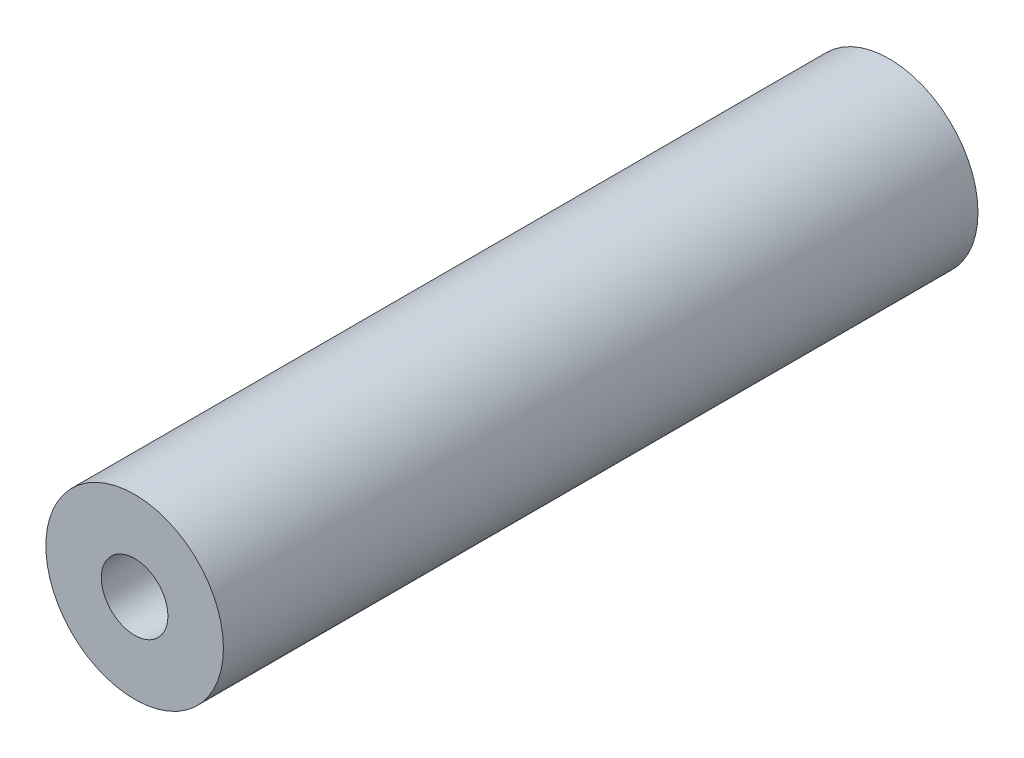
ISO-10303-21;
HEADER;
FILE_DESCRIPTION(('STEP AP214'),'2;1');
FILE_NAME('part.step','',(''),(''),'','','');
FILE_SCHEMA(('AUTOMOTIVE_DESIGN { 1 0 10303 214 1 1 1 1 }'));
ENDSEC;
DATA;
#1=APPLICATION_CONTEXT('core data for automotive mechanical design processes');
#2=APPLICATION_PROTOCOL_DEFINITION('international standard','automotive_design',2000,#1);
#3=PRODUCT_CONTEXT('',#1,'mechanical');
#4=PRODUCT('Part','Part','',(#3));
#5=PRODUCT_RELATED_PRODUCT_CATEGORY('part','',(#4));
#6=PRODUCT_DEFINITION_FORMATION('','',#4);
#7=PRODUCT_DEFINITION_CONTEXT('part definition',#1,'design');
#8=PRODUCT_DEFINITION('design','',#6,#7);
#9=PRODUCT_DEFINITION_SHAPE('','',#8);
#10=(LENGTH_UNIT() NAMED_UNIT(*) SI_UNIT(.MILLI.,.METRE.));
#11=(NAMED_UNIT(*) PLANE_ANGLE_UNIT() SI_UNIT($,.RADIAN.));
#12=(NAMED_UNIT(*) SI_UNIT($,.STERADIAN.) SOLID_ANGLE_UNIT());
#13=UNCERTAINTY_MEASURE_WITH_UNIT(LENGTH_MEASURE(1.E-05),#10,'distance_accuracy_value','');
#14=(GEOMETRIC_REPRESENTATION_CONTEXT(3) GLOBAL_UNCERTAINTY_ASSIGNED_CONTEXT((#13)) GLOBAL_UNIT_ASSIGNED_CONTEXT((#10,
#11,#12)) REPRESENTATION_CONTEXT('',''));
#15=CARTESIAN_POINT('',(0.,0.,0.));
#16=DIRECTION('',(0.,0.,1.));
#17=DIRECTION('',(1.,0.,0.));
#18=AXIS2_PLACEMENT_3D('',#15,#16,#17);
#19=CARTESIAN_POINT('',(0.,0.,34.));
#20=DIRECTION('',(0.,0.,1.));
#21=DIRECTION('',(1.,0.,0.));
#22=AXIS2_PLACEMENT_3D('',#19,#20,#21);
#23=PLANE('',#22);
#24=CARTESIAN_POINT('',(0.,0.,34.));
#25=DIRECTION('',(0.,0.,1.));
#26=DIRECTION('',(1.,0.,0.));
#27=AXIS2_PLACEMENT_3D('',#24,#25,#26);
#28=CIRCLE('',#27,4.);
#29=CARTESIAN_POINT('',(4.,0.,34.));
#30=VERTEX_POINT('',#29);
#31=EDGE_CURVE('E10',#30,#30,#28,.T.);
#32=ORIENTED_EDGE('',*,*,#31,.T.);
#33=EDGE_LOOP('',(#32));
#34=FACE_BOUND('',#33,.T.);
#35=CARTESIAN_POINT('',(0.,0.,34.));
#36=DIRECTION('',(0.,0.,1.));
#37=DIRECTION('',(1.,0.,0.));
#38=AXIS2_PLACEMENT_3D('',#35,#36,#37);
#39=CIRCLE('',#38,1.5);
#40=CARTESIAN_POINT('',(1.5,0.,34.));
#41=VERTEX_POINT('',#40);
#42=EDGE_CURVE('E42',#41,#41,#39,.T.);
#43=ORIENTED_EDGE('',*,*,#42,.F.);
#44=EDGE_LOOP('',(#43));
#45=FACE_BOUND('',#44,.T.);
#46=ADVANCED_FACE('F31',(#34,#45),#23,.T.);
#47=CARTESIAN_POINT('',(0.,0.,0.));
#48=DIRECTION('',(0.,0.,1.));
#49=DIRECTION('',(1.,0.,0.));
#50=AXIS2_PLACEMENT_3D('',#47,#48,#49);
#51=PLANE('',#50);
#52=CARTESIAN_POINT('',(0.,0.,0.));
#53=DIRECTION('',(0.,0.,1.));
#54=DIRECTION('',(1.,0.,0.));
#55=AXIS2_PLACEMENT_3D('',#52,#53,#54);
#56=CIRCLE('',#55,4.);
#57=CARTESIAN_POINT('',(4.,0.,0.));
#58=VERTEX_POINT('',#57);
#59=EDGE_CURVE('E35',#58,#58,#56,.T.);
#60=ORIENTED_EDGE('',*,*,#59,.F.);
#61=EDGE_LOOP('',(#60));
#62=FACE_BOUND('',#61,.T.);
#63=CARTESIAN_POINT('',(0.,0.,0.));
#64=DIRECTION('',(0.,0.,1.));
#65=DIRECTION('',(1.,0.,0.));
#66=AXIS2_PLACEMENT_3D('',#63,#64,#65);
#67=CIRCLE('',#66,1.5);
#68=CARTESIAN_POINT('',(1.5,0.,0.));
#69=VERTEX_POINT('',#68);
#70=EDGE_CURVE('E44',#69,#69,#67,.T.);
#71=ORIENTED_EDGE('',*,*,#70,.T.);
#72=EDGE_LOOP('',(#71));
#73=FACE_BOUND('',#72,.T.);
#74=ADVANCED_FACE('F54',(#62,#73),#51,.F.);
#75=CARTESIAN_POINT('',(0.,0.,34.));
#76=DIRECTION('',(0.,0.,-1.));
#77=DIRECTION('',(-1.,0.,0.));
#78=AXIS2_PLACEMENT_3D('',#75,#76,#77);
#79=CYLINDRICAL_SURFACE('',#78,4.);
#80=ORIENTED_EDGE('',*,*,#31,.F.);
#81=EDGE_LOOP('',(#80));
#82=FACE_BOUND('',#81,.T.);
#83=ORIENTED_EDGE('',*,*,#59,.T.);
#84=EDGE_LOOP('',(#83));
#85=FACE_BOUND('',#84,.T.);
#86=ADVANCED_FACE('F33',(#82,#85),#79,.T.);
#87=CARTESIAN_POINT('',(0.,0.,34.));
#88=DIRECTION('',(0.,0.,-1.));
#89=DIRECTION('',(-1.,0.,0.));
#90=AXIS2_PLACEMENT_3D('',#87,#88,#89);
#91=CYLINDRICAL_SURFACE('',#90,1.5);
#92=ORIENTED_EDGE('',*,*,#42,.T.);
#93=EDGE_LOOP('',(#92));
#94=FACE_BOUND('',#93,.T.);
#95=ORIENTED_EDGE('',*,*,#70,.F.);
#96=EDGE_LOOP('',(#95));
#97=FACE_BOUND('',#96,.T.);
#98=ADVANCED_FACE('F50',(#94,#97),#91,.F.);
#99=CLOSED_SHELL('',(#46,#74,#86,#98));
#100=MANIFOLD_SOLID_BREP('B2',#99);
#101=ADVANCED_BREP_SHAPE_REPRESENTATION('',(#18,#100),#14);
#102=SHAPE_DEFINITION_REPRESENTATION(#9,#101);
ENDSEC;
END-ISO-10303-21;
